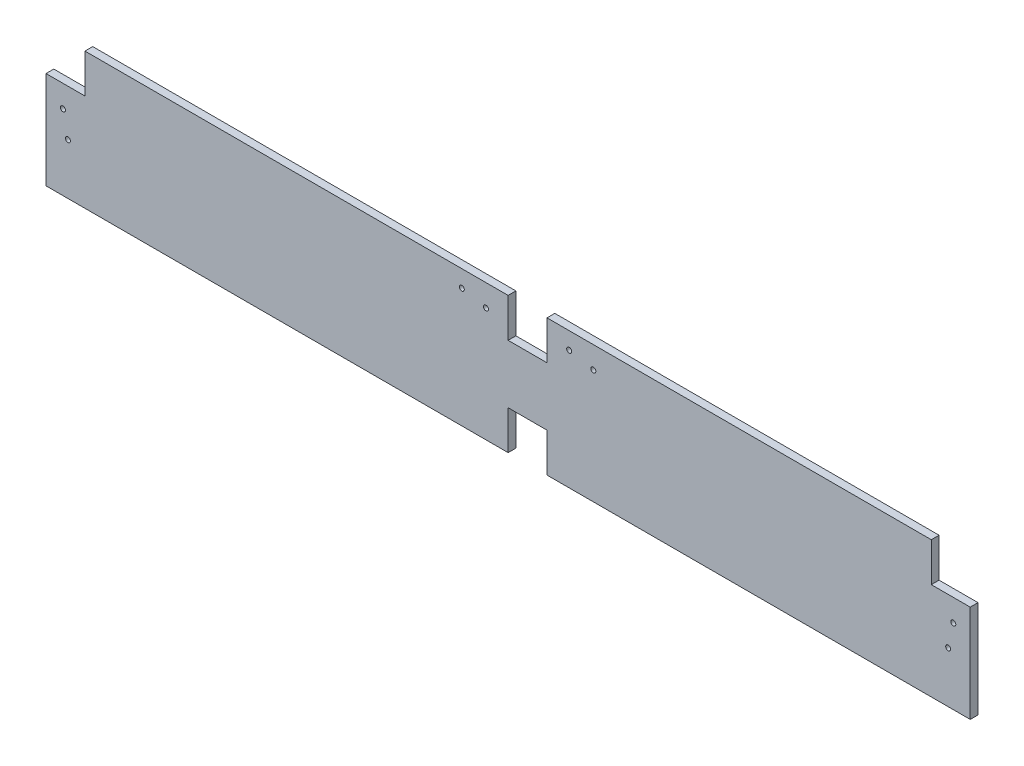
ISO-10303-21;
HEADER;
FILE_DESCRIPTION(('STEP AP214'),'2;1');
FILE_NAME('part.step','',(''),(''),'','','');
FILE_SCHEMA(('AUTOMOTIVE_DESIGN { 1 0 10303 214 1 1 1 1 }'));
ENDSEC;
DATA;
#1=APPLICATION_CONTEXT('core data for automotive mechanical design processes');
#2=APPLICATION_PROTOCOL_DEFINITION('international standard','automotive_design',2000,#1);
#3=PRODUCT_CONTEXT('',#1,'mechanical');
#4=PRODUCT('Part','Part','',(#3));
#5=PRODUCT_RELATED_PRODUCT_CATEGORY('part','',(#4));
#6=PRODUCT_DEFINITION_FORMATION('','',#4);
#7=PRODUCT_DEFINITION_CONTEXT('part definition',#1,'design');
#8=PRODUCT_DEFINITION('design','',#6,#7);
#9=PRODUCT_DEFINITION_SHAPE('','',#8);
#10=(LENGTH_UNIT() NAMED_UNIT(*) SI_UNIT(.MILLI.,.METRE.));
#11=(NAMED_UNIT(*) PLANE_ANGLE_UNIT() SI_UNIT($,.RADIAN.));
#12=(NAMED_UNIT(*) SI_UNIT($,.STERADIAN.) SOLID_ANGLE_UNIT());
#13=UNCERTAINTY_MEASURE_WITH_UNIT(LENGTH_MEASURE(1.E-05),#10,'distance_accuracy_value','');
#14=(GEOMETRIC_REPRESENTATION_CONTEXT(3) GLOBAL_UNCERTAINTY_ASSIGNED_CONTEXT((#13)) GLOBAL_UNIT_ASSIGNED_CONTEXT((#10,
#11,#12)) REPRESENTATION_CONTEXT('',''));
#15=CARTESIAN_POINT('',(0.,0.,0.));
#16=DIRECTION('',(0.,0.,1.));
#17=DIRECTION('',(1.,0.,0.));
#18=AXIS2_PLACEMENT_3D('',#15,#16,#17);
#19=CARTESIAN_POINT('',(301.625,-44.4499999999999,2.54));
#20=DIRECTION('',(0.,1.,0.));
#21=DIRECTION('',(-1.,0.,0.));
#22=AXIS2_PLACEMENT_3D('',#19,#20,#21);
#23=PLANE('',#22);
#24=DIRECTION('',(1.,0.,0.));
#25=VECTOR('',#24,1.);
#26=CARTESIAN_POINT('',(301.625,-44.4499999999999,-2.54));
#27=LINE('',#26,#25);
#28=CARTESIAN_POINT('',(-301.625,-44.45,-2.54));
#29=VERTEX_POINT('',#28);
#30=CARTESIAN_POINT('',(0.,-44.45,-2.54));
#31=VERTEX_POINT('',#30);
#32=EDGE_CURVE('E167',#29,#31,#27,.T.);
#33=ORIENTED_EDGE('',*,*,#32,.T.);
#34=DIRECTION('',(0.,0.,1.));
#35=VECTOR('',#34,1.);
#36=CARTESIAN_POINT('',(0.,-44.45,-2.54));
#37=LINE('',#36,#35);
#38=CARTESIAN_POINT('',(0.,-44.45,2.54));
#39=VERTEX_POINT('',#38);
#40=EDGE_CURVE('E208',#31,#39,#37,.T.);
#41=ORIENTED_EDGE('',*,*,#40,.T.);
#42=DIRECTION('',(1.,0.,0.));
#43=VECTOR('',#42,1.);
#44=CARTESIAN_POINT('',(301.625,-44.4499999999999,2.54));
#45=LINE('',#44,#43);
#46=CARTESIAN_POINT('',(-301.625,-44.45,2.54));
#47=VERTEX_POINT('',#46);
#48=EDGE_CURVE('E201',#47,#39,#45,.T.);
#49=ORIENTED_EDGE('',*,*,#48,.F.);
#50=DIRECTION('',(0.,0.,-1.));
#51=VECTOR('',#50,1.);
#52=CARTESIAN_POINT('',(-301.625,-44.45,2.54));
#53=LINE('',#52,#51);
#54=EDGE_CURVE('E11',#47,#29,#53,.T.);
#55=ORIENTED_EDGE('',*,*,#54,.T.);
#56=EDGE_LOOP('',(#33,#41,#49,#55));
#57=FACE_BOUND('',#56,.T.);
#58=ADVANCED_FACE('F34',(#57),#23,.F.);
#59=CARTESIAN_POINT('',(301.625,44.4500000000001,2.54));
#60=DIRECTION('',(0.,-1.,0.));
#61=DIRECTION('',(1.,0.,0.));
#62=AXIS2_PLACEMENT_3D('',#59,#60,#61);
#63=PLANE('',#62);
#64=DIRECTION('',(-1.,0.,0.));
#65=VECTOR('',#64,1.);
#66=CARTESIAN_POINT('',(301.625,44.4500000000001,-2.54));
#67=LINE('',#66,#65);
#68=CARTESIAN_POINT('',(0.,44.45,-2.54));
#69=VERTEX_POINT('',#68);
#70=CARTESIAN_POINT('',(-276.225,44.45,-2.54));
#71=VERTEX_POINT('',#70);
#72=EDGE_CURVE('E181',#69,#71,#67,.T.);
#73=ORIENTED_EDGE('',*,*,#72,.T.);
#74=DIRECTION('',(0.,0.,1.));
#75=VECTOR('',#74,1.);
#76=CARTESIAN_POINT('',(-276.225,44.45,-2.54));
#77=LINE('',#76,#75);
#78=CARTESIAN_POINT('',(-276.225,44.45,2.54));
#79=VERTEX_POINT('',#78);
#80=EDGE_CURVE('E169',#71,#79,#77,.T.);
#81=ORIENTED_EDGE('',*,*,#80,.T.);
#82=DIRECTION('',(-1.,0.,0.));
#83=VECTOR('',#82,1.);
#84=CARTESIAN_POINT('',(301.625,44.4500000000001,2.54));
#85=LINE('',#84,#83);
#86=CARTESIAN_POINT('',(0.,44.45,2.54));
#87=VERTEX_POINT('',#86);
#88=EDGE_CURVE('E175',#87,#79,#85,.T.);
#89=ORIENTED_EDGE('',*,*,#88,.F.);
#90=DIRECTION('',(0.,0.,1.));
#91=VECTOR('',#90,1.);
#92=CARTESIAN_POINT('',(0.,44.45,-2.54));
#93=LINE('',#92,#91);
#94=EDGE_CURVE('E260',#69,#87,#93,.T.);
#95=ORIENTED_EDGE('',*,*,#94,.F.);
#96=EDGE_LOOP('',(#73,#81,#89,#95));
#97=FACE_BOUND('',#96,.T.);
#98=ADVANCED_FACE('F374',(#97),#63,.F.);
#99=CARTESIAN_POINT('',(-301.625,44.45,2.54));
#100=DIRECTION('',(1.,0.,0.));
#101=DIRECTION('',(0.,1.,0.));
#102=AXIS2_PLACEMENT_3D('',#99,#100,#101);
#103=PLANE('',#102);
#104=DIRECTION('',(0.,-1.,0.));
#105=VECTOR('',#104,1.);
#106=CARTESIAN_POINT('',(-301.625,44.45,2.54));
#107=LINE('',#106,#105);
#108=CARTESIAN_POINT('',(-301.625,19.05,2.54));
#109=VERTEX_POINT('',#108);
#110=EDGE_CURVE('E162',#109,#47,#107,.T.);
#111=ORIENTED_EDGE('',*,*,#110,.F.);
#112=DIRECTION('',(0.,0.,1.));
#113=VECTOR('',#112,1.);
#114=CARTESIAN_POINT('',(-301.625,19.05,-2.54));
#115=LINE('',#114,#113);
#116=CARTESIAN_POINT('',(-301.625,19.05,-2.54));
#117=VERTEX_POINT('',#116);
#118=EDGE_CURVE('E150',#117,#109,#115,.T.);
#119=ORIENTED_EDGE('',*,*,#118,.F.);
#120=DIRECTION('',(0.,-1.,0.));
#121=VECTOR('',#120,1.);
#122=CARTESIAN_POINT('',(-301.625,44.45,-2.54));
#123=LINE('',#122,#121);
#124=EDGE_CURVE('E160',#117,#29,#123,.T.);
#125=ORIENTED_EDGE('',*,*,#124,.T.);
#126=ORIENTED_EDGE('',*,*,#54,.F.);
#127=EDGE_LOOP('',(#111,#119,#125,#126));
#128=FACE_BOUND('',#127,.T.);
#129=ADVANCED_FACE('F36',(#128),#103,.F.);
#130=CARTESIAN_POINT('',(25.4000000000001,-44.45,2.54));
#131=VERTEX_POINT('',#130);
#132=CARTESIAN_POINT('',(301.625,-44.4499999999999,2.54));
#133=VERTEX_POINT('',#132);
#134=EDGE_CURVE('E204',#131,#133,#45,.T.);
#135=ORIENTED_EDGE('',*,*,#134,.F.);
#136=DIRECTION('',(0.,0.,1.));
#137=VECTOR('',#136,1.);
#138=CARTESIAN_POINT('',(25.4000000000001,-44.45,-2.54));
#139=LINE('',#138,#137);
#140=CARTESIAN_POINT('',(25.4000000000001,-44.45,-2.54));
#141=VERTEX_POINT('',#140);
#142=EDGE_CURVE('E211',#141,#131,#139,.T.);
#143=ORIENTED_EDGE('',*,*,#142,.F.);
#144=CARTESIAN_POINT('',(301.625,-44.4499999999999,-2.54));
#145=VERTEX_POINT('',#144);
#146=EDGE_CURVE('E168',#141,#145,#27,.T.);
#147=ORIENTED_EDGE('',*,*,#146,.T.);
#148=DIRECTION('',(0.,0.,-1.));
#149=VECTOR('',#148,1.);
#150=CARTESIAN_POINT('',(301.625,-44.4499999999999,2.54));
#151=LINE('',#150,#149);
#152=EDGE_CURVE('E42',#133,#145,#151,.T.);
#153=ORIENTED_EDGE('',*,*,#152,.F.);
#154=EDGE_LOOP('',(#135,#143,#147,#153));
#155=FACE_BOUND('',#154,.T.);
#156=ADVANCED_FACE('F376',(#155),#23,.F.);
#157=CARTESIAN_POINT('',(301.625,44.4500000000001,2.54));
#158=DIRECTION('',(-1.,0.,0.));
#159=DIRECTION('',(0.,0.,1.));
#160=AXIS2_PLACEMENT_3D('',#157,#158,#159);
#161=PLANE('',#160);
#162=DIRECTION('',(0.,1.,0.));
#163=VECTOR('',#162,1.);
#164=CARTESIAN_POINT('',(301.625,44.4500000000001,-2.54));
#165=LINE('',#164,#163);
#166=CARTESIAN_POINT('',(301.625,19.05,-2.54));
#167=VERTEX_POINT('',#166);
#168=EDGE_CURVE('E178',#145,#167,#165,.T.);
#169=ORIENTED_EDGE('',*,*,#168,.T.);
#170=DIRECTION('',(0.,0.,1.));
#171=VECTOR('',#170,1.);
#172=CARTESIAN_POINT('',(301.625,19.05,-2.54));
#173=LINE('',#172,#171);
#174=CARTESIAN_POINT('',(301.625,19.05,2.54));
#175=VERTEX_POINT('',#174);
#176=EDGE_CURVE('E240',#167,#175,#173,.T.);
#177=ORIENTED_EDGE('',*,*,#176,.T.);
#178=DIRECTION('',(0.,1.,0.));
#179=VECTOR('',#178,1.);
#180=CARTESIAN_POINT('',(301.625,44.4500000000001,2.54));
#181=LINE('',#180,#179);
#182=EDGE_CURVE('E196',#133,#175,#181,.T.);
#183=ORIENTED_EDGE('',*,*,#182,.F.);
#184=ORIENTED_EDGE('',*,*,#152,.T.);
#185=EDGE_LOOP('',(#169,#177,#183,#184));
#186=FACE_BOUND('',#185,.T.);
#187=ADVANCED_FACE('F384',(#186),#161,.F.);
#188=CARTESIAN_POINT('',(276.225,44.4500000000001,-2.54));
#189=VERTEX_POINT('',#188);
#190=CARTESIAN_POINT('',(25.4000000000001,44.45,-2.54));
#191=VERTEX_POINT('',#190);
#192=EDGE_CURVE('E183',#189,#191,#67,.T.);
#193=ORIENTED_EDGE('',*,*,#192,.T.);
#194=DIRECTION('',(0.,0.,1.));
#195=VECTOR('',#194,1.);
#196=CARTESIAN_POINT('',(25.4000000000001,44.45,-2.54));
#197=LINE('',#196,#195);
#198=CARTESIAN_POINT('',(25.4000000000001,44.45,2.54));
#199=VERTEX_POINT('',#198);
#200=EDGE_CURVE('E257',#191,#199,#197,.T.);
#201=ORIENTED_EDGE('',*,*,#200,.T.);
#202=CARTESIAN_POINT('',(276.225,44.4500000000001,2.54));
#203=VERTEX_POINT('',#202);
#204=EDGE_CURVE('E185',#203,#199,#85,.T.);
#205=ORIENTED_EDGE('',*,*,#204,.F.);
#206=DIRECTION('',(0.,0.,1.));
#207=VECTOR('',#206,1.);
#208=CARTESIAN_POINT('',(276.225,44.4500000000001,-2.54));
#209=LINE('',#208,#207);
#210=EDGE_CURVE('E235',#189,#203,#209,.T.);
#211=ORIENTED_EDGE('',*,*,#210,.F.);
#212=EDGE_LOOP('',(#193,#201,#205,#211));
#213=FACE_BOUND('',#212,.T.);
#214=ADVANCED_FACE('F341',(#213),#63,.F.);
#215=CARTESIAN_POINT('',(0.,0.,2.54));
#216=DIRECTION('',(0.,0.,-1.));
#217=DIRECTION('',(-1.,0.,0.));
#218=AXIS2_PLACEMENT_3D('',#215,#216,#217);
#219=PLANE('',#218);
#220=CARTESIAN_POINT('',(55.626,30.099,2.54));
#221=DIRECTION('',(0.,0.,1.));
#222=DIRECTION('',(1.,0.,0.));
#223=AXIS2_PLACEMENT_3D('',#220,#221,#222);
#224=CIRCLE('',#223,1.63195);
#225=CARTESIAN_POINT('',(57.25795,30.099,2.54));
#226=VERTEX_POINT('',#225);
#227=EDGE_CURVE('E323',#226,#226,#224,.T.);
#228=ORIENTED_EDGE('',*,*,#227,.F.);
#229=EDGE_LOOP('',(#228));
#230=FACE_BOUND('',#229,.T.);
#231=CARTESIAN_POINT('',(39.878,33.401,2.54));
#232=DIRECTION('',(0.,0.,1.));
#233=DIRECTION('',(1.,0.,0.));
#234=AXIS2_PLACEMENT_3D('',#231,#232,#233);
#235=CIRCLE('',#234,1.63195);
#236=CARTESIAN_POINT('',(41.50995,33.401,2.54));
#237=VERTEX_POINT('',#236);
#238=EDGE_CURVE('E317',#237,#237,#235,.T.);
#239=ORIENTED_EDGE('',*,*,#238,.F.);
#240=EDGE_LOOP('',(#239));
#241=FACE_BOUND('',#240,.T.);
#242=CARTESIAN_POINT('',(290.576,4.57199999999998,2.54));
#243=DIRECTION('',(0.,0.,-1.));
#244=DIRECTION('',(-1.,0.,0.));
#245=AXIS2_PLACEMENT_3D('',#242,#243,#244);
#246=CIRCLE('',#245,1.63195);
#247=CARTESIAN_POINT('',(288.94405,4.57199999999998,2.54));
#248=VERTEX_POINT('',#247);
#249=EDGE_CURVE('E312',#248,#248,#246,.T.);
#250=ORIENTED_EDGE('',*,*,#249,.T.);
#251=EDGE_LOOP('',(#250));
#252=FACE_BOUND('',#251,.T.);
#253=CARTESIAN_POINT('',(287.274,-11.176,2.54));
#254=DIRECTION('',(0.,0.,-1.));
#255=DIRECTION('',(-1.,0.,0.));
#256=AXIS2_PLACEMENT_3D('',#253,#254,#255);
#257=CIRCLE('',#256,1.63195);
#258=CARTESIAN_POINT('',(285.64205,-11.176,2.54));
#259=VERTEX_POINT('',#258);
#260=EDGE_CURVE('E305',#259,#259,#257,.T.);
#261=ORIENTED_EDGE('',*,*,#260,.T.);
#262=EDGE_LOOP('',(#261));
#263=FACE_BOUND('',#262,.T.);
#264=CARTESIAN_POINT('',(-290.576,4.57199999999998,2.54));
#265=DIRECTION('',(0.,0.,1.));
#266=DIRECTION('',(1.,0.,0.));
#267=AXIS2_PLACEMENT_3D('',#264,#265,#266);
#268=CIRCLE('',#267,1.63195);
#269=CARTESIAN_POINT('',(-288.94405,4.57199999999998,2.54));
#270=VERTEX_POINT('',#269);
#271=EDGE_CURVE('E300',#270,#270,#268,.T.);
#272=ORIENTED_EDGE('',*,*,#271,.F.);
#273=EDGE_LOOP('',(#272));
#274=FACE_BOUND('',#273,.T.);
#275=CARTESIAN_POINT('',(-287.274,-11.176,2.54));
#276=DIRECTION('',(0.,0.,1.));
#277=DIRECTION('',(1.,0.,0.));
#278=AXIS2_PLACEMENT_3D('',#275,#276,#277);
#279=CIRCLE('',#278,1.63195);
#280=CARTESIAN_POINT('',(-285.64205,-11.176,2.54));
#281=VERTEX_POINT('',#280);
#282=EDGE_CURVE('E293',#281,#281,#279,.T.);
#283=ORIENTED_EDGE('',*,*,#282,.F.);
#284=EDGE_LOOP('',(#283));
#285=FACE_BOUND('',#284,.T.);
#286=CARTESIAN_POINT('',(-14.478,30.099,2.54));
#287=DIRECTION('',(0.,0.,1.));
#288=DIRECTION('',(1.,0.,0.));
#289=AXIS2_PLACEMENT_3D('',#286,#287,#288);
#290=CIRCLE('',#289,1.63195);
#291=CARTESIAN_POINT('',(-12.84605,30.099,2.54));
#292=VERTEX_POINT('',#291);
#293=EDGE_CURVE('E288',#292,#292,#290,.T.);
#294=ORIENTED_EDGE('',*,*,#293,.F.);
#295=EDGE_LOOP('',(#294));
#296=FACE_BOUND('',#295,.T.);
#297=CARTESIAN_POINT('',(-30.226,33.401,2.54));
#298=DIRECTION('',(0.,0.,1.));
#299=DIRECTION('',(1.,0.,0.));
#300=AXIS2_PLACEMENT_3D('',#297,#298,#299);
#301=CIRCLE('',#300,1.63195);
#302=CARTESIAN_POINT('',(-28.59405,33.401,2.54));
#303=VERTEX_POINT('',#302);
#304=EDGE_CURVE('E281',#303,#303,#301,.T.);
#305=ORIENTED_EDGE('',*,*,#304,.F.);
#306=EDGE_LOOP('',(#305));
#307=FACE_BOUND('',#306,.T.);
#308=ORIENTED_EDGE('',*,*,#88,.T.);
#309=DIRECTION('',(0.,1.,0.));
#310=VECTOR('',#309,1.);
#311=CARTESIAN_POINT('',(-276.225,44.45,2.54));
#312=LINE('',#311,#310);
#313=CARTESIAN_POINT('',(-276.225,19.05,2.54));
#314=VERTEX_POINT('',#313);
#315=EDGE_CURVE('E155',#314,#79,#312,.T.);
#316=ORIENTED_EDGE('',*,*,#315,.F.);
#317=DIRECTION('',(1.,0.,0.));
#318=VECTOR('',#317,1.);
#319=CARTESIAN_POINT('',(-301.625,19.05,2.54));
#320=LINE('',#319,#318);
#321=EDGE_CURVE('E262',#109,#314,#320,.T.);
#322=ORIENTED_EDGE('',*,*,#321,.F.);
#323=ORIENTED_EDGE('',*,*,#110,.T.);
#324=ORIENTED_EDGE('',*,*,#48,.T.);
#325=DIRECTION('',(0.,-1.,0.));
#326=VECTOR('',#325,1.);
#327=CARTESIAN_POINT('',(0.,-44.45,2.54));
#328=LINE('',#327,#326);
#329=CARTESIAN_POINT('',(0.,-19.05,2.54));
#330=VERTEX_POINT('',#329);
#331=EDGE_CURVE('E226',#330,#39,#328,.T.);
#332=ORIENTED_EDGE('',*,*,#331,.F.);
#333=DIRECTION('',(-1.,0.,0.));
#334=VECTOR('',#333,1.);
#335=CARTESIAN_POINT('',(0.,-19.05,2.54));
#336=LINE('',#335,#334);
#337=CARTESIAN_POINT('',(25.4000000000001,-19.05,2.54));
#338=VERTEX_POINT('',#337);
#339=EDGE_CURVE('E219',#338,#330,#336,.T.);
#340=ORIENTED_EDGE('',*,*,#339,.F.);
#341=DIRECTION('',(0.,1.,0.));
#342=VECTOR('',#341,1.);
#343=CARTESIAN_POINT('',(25.4000000000001,-44.45,2.54));
#344=LINE('',#343,#342);
#345=EDGE_CURVE('E223',#131,#338,#344,.T.);
#346=ORIENTED_EDGE('',*,*,#345,.F.);
#347=ORIENTED_EDGE('',*,*,#134,.T.);
#348=ORIENTED_EDGE('',*,*,#182,.T.);
#349=DIRECTION('',(1.,0.,0.));
#350=VECTOR('',#349,1.);
#351=CARTESIAN_POINT('',(301.625,19.05,2.54));
#352=LINE('',#351,#350);
#353=CARTESIAN_POINT('',(276.225,19.05,2.54));
#354=VERTEX_POINT('',#353);
#355=EDGE_CURVE('E244',#354,#175,#352,.T.);
#356=ORIENTED_EDGE('',*,*,#355,.F.);
#357=DIRECTION('',(0.,-1.,0.));
#358=VECTOR('',#357,1.);
#359=CARTESIAN_POINT('',(276.225,44.4500000000001,2.54));
#360=LINE('',#359,#358);
#361=EDGE_CURVE('E218',#203,#354,#360,.T.);
#362=ORIENTED_EDGE('',*,*,#361,.F.);
#363=ORIENTED_EDGE('',*,*,#204,.T.);
#364=DIRECTION('',(0.,1.,0.));
#365=VECTOR('',#364,1.);
#366=CARTESIAN_POINT('',(25.4000000000001,44.45,2.54));
#367=LINE('',#366,#365);
#368=CARTESIAN_POINT('',(25.4000000000001,19.05,2.54));
#369=VERTEX_POINT('',#368);
#370=EDGE_CURVE('E263',#369,#199,#367,.T.);
#371=ORIENTED_EDGE('',*,*,#370,.F.);
#372=DIRECTION('',(1.,0.,0.));
#373=VECTOR('',#372,1.);
#374=CARTESIAN_POINT('',(0.,19.05,2.54));
#375=LINE('',#374,#373);
#376=CARTESIAN_POINT('',(0.,19.05,2.54));
#377=VERTEX_POINT('',#376);
#378=EDGE_CURVE('E266',#377,#369,#375,.T.);
#379=ORIENTED_EDGE('',*,*,#378,.F.);
#380=DIRECTION('',(0.,-1.,0.));
#381=VECTOR('',#380,1.);
#382=CARTESIAN_POINT('',(0.,44.45,2.54));
#383=LINE('',#382,#381);
#384=EDGE_CURVE('E243',#87,#377,#383,.T.);
#385=ORIENTED_EDGE('',*,*,#384,.F.);
#386=EDGE_LOOP('',(#308,#316,#322,#323,#324,#332,#340,#346,#347,#348,#356,#362,#363,#371,#379,#385));
#387=FACE_BOUND('',#386,.T.);
#388=ADVANCED_FACE('F338',(#230,#241,#252,#263,#274,#285,#296,#307,#387),#219,.F.);
#389=CARTESIAN_POINT('',(0.,0.,-2.54));
#390=DIRECTION('',(0.,0.,-1.));
#391=DIRECTION('',(-1.,0.,0.));
#392=AXIS2_PLACEMENT_3D('',#389,#390,#391);
#393=PLANE('',#392);
#394=CARTESIAN_POINT('',(55.626,30.099,-2.54));
#395=DIRECTION('',(0.,0.,1.));
#396=DIRECTION('',(1.,0.,0.));
#397=AXIS2_PLACEMENT_3D('',#394,#395,#396);
#398=CIRCLE('',#397,1.63195);
#399=CARTESIAN_POINT('',(57.25795,30.099,-2.54));
#400=VERTEX_POINT('',#399);
#401=EDGE_CURVE('E309',#400,#400,#398,.T.);
#402=ORIENTED_EDGE('',*,*,#401,.T.);
#403=EDGE_LOOP('',(#402));
#404=FACE_BOUND('',#403,.T.);
#405=CARTESIAN_POINT('',(39.878,33.401,-2.54));
#406=DIRECTION('',(0.,0.,1.));
#407=DIRECTION('',(1.,0.,0.));
#408=AXIS2_PLACEMENT_3D('',#405,#406,#407);
#409=CIRCLE('',#408,1.63195);
#410=CARTESIAN_POINT('',(41.50995,33.401,-2.54));
#411=VERTEX_POINT('',#410);
#412=EDGE_CURVE('E320',#411,#411,#409,.T.);
#413=ORIENTED_EDGE('',*,*,#412,.T.);
#414=EDGE_LOOP('',(#413));
#415=FACE_BOUND('',#414,.T.);
#416=CARTESIAN_POINT('',(290.576,4.57199999999998,-2.54));
#417=DIRECTION('',(0.,0.,-1.));
#418=DIRECTION('',(-1.,0.,0.));
#419=AXIS2_PLACEMENT_3D('',#416,#417,#418);
#420=CIRCLE('',#419,1.63195);
#421=CARTESIAN_POINT('',(288.94405,4.57199999999998,-2.54));
#422=VERTEX_POINT('',#421);
#423=EDGE_CURVE('E297',#422,#422,#420,.T.);
#424=ORIENTED_EDGE('',*,*,#423,.F.);
#425=EDGE_LOOP('',(#424));
#426=FACE_BOUND('',#425,.T.);
#427=CARTESIAN_POINT('',(287.274,-11.176,-2.54));
#428=DIRECTION('',(0.,0.,-1.));
#429=DIRECTION('',(-1.,0.,0.));
#430=AXIS2_PLACEMENT_3D('',#427,#428,#429);
#431=CIRCLE('',#430,1.63195);
#432=CARTESIAN_POINT('',(285.64205,-11.176,-2.54));
#433=VERTEX_POINT('',#432);
#434=EDGE_CURVE('E308',#433,#433,#431,.T.);
#435=ORIENTED_EDGE('',*,*,#434,.F.);
#436=EDGE_LOOP('',(#435));
#437=FACE_BOUND('',#436,.T.);
#438=CARTESIAN_POINT('',(-290.576,4.57199999999998,-2.54));
#439=DIRECTION('',(0.,0.,1.));
#440=DIRECTION('',(1.,0.,0.));
#441=AXIS2_PLACEMENT_3D('',#438,#439,#440);
#442=CIRCLE('',#441,1.63195);
#443=CARTESIAN_POINT('',(-288.94405,4.57199999999998,-2.54));
#444=VERTEX_POINT('',#443);
#445=EDGE_CURVE('E285',#444,#444,#442,.T.);
#446=ORIENTED_EDGE('',*,*,#445,.T.);
#447=EDGE_LOOP('',(#446));
#448=FACE_BOUND('',#447,.T.);
#449=CARTESIAN_POINT('',(-287.274,-11.176,-2.54));
#450=DIRECTION('',(0.,0.,1.));
#451=DIRECTION('',(1.,0.,0.));
#452=AXIS2_PLACEMENT_3D('',#449,#450,#451);
#453=CIRCLE('',#452,1.63195);
#454=CARTESIAN_POINT('',(-285.64205,-11.176,-2.54));
#455=VERTEX_POINT('',#454);
#456=EDGE_CURVE('E296',#455,#455,#453,.T.);
#457=ORIENTED_EDGE('',*,*,#456,.T.);
#458=EDGE_LOOP('',(#457));
#459=FACE_BOUND('',#458,.T.);
#460=CARTESIAN_POINT('',(-14.478,30.099,-2.54));
#461=DIRECTION('',(0.,0.,1.));
#462=DIRECTION('',(1.,0.,0.));
#463=AXIS2_PLACEMENT_3D('',#460,#461,#462);
#464=CIRCLE('',#463,1.63195);
#465=CARTESIAN_POINT('',(-12.84605,30.099,-2.54));
#466=VERTEX_POINT('',#465);
#467=EDGE_CURVE('E228',#466,#466,#464,.T.);
#468=ORIENTED_EDGE('',*,*,#467,.T.);
#469=EDGE_LOOP('',(#468));
#470=FACE_BOUND('',#469,.T.);
#471=CARTESIAN_POINT('',(-30.226,33.401,-2.54));
#472=DIRECTION('',(0.,0.,1.));
#473=DIRECTION('',(1.,0.,0.));
#474=AXIS2_PLACEMENT_3D('',#471,#472,#473);
#475=CIRCLE('',#474,1.63195);
#476=CARTESIAN_POINT('',(-28.59405,33.401,-2.54));
#477=VERTEX_POINT('',#476);
#478=EDGE_CURVE('E284',#477,#477,#475,.T.);
#479=ORIENTED_EDGE('',*,*,#478,.T.);
#480=EDGE_LOOP('',(#479));
#481=FACE_BOUND('',#480,.T.);
#482=DIRECTION('',(0.,1.,0.));
#483=VECTOR('',#482,1.);
#484=CARTESIAN_POINT('',(-276.225,44.45,-2.54));
#485=LINE('',#484,#483);
#486=CARTESIAN_POINT('',(-276.225,19.05,-2.54));
#487=VERTEX_POINT('',#486);
#488=EDGE_CURVE('E49',#487,#71,#485,.T.);
#489=ORIENTED_EDGE('',*,*,#488,.T.);
#490=ORIENTED_EDGE('',*,*,#72,.F.);
#491=DIRECTION('',(0.,-1.,0.));
#492=VECTOR('',#491,1.);
#493=CARTESIAN_POINT('',(0.,44.45,-2.54));
#494=LINE('',#493,#492);
#495=CARTESIAN_POINT('',(0.,19.05,-2.54));
#496=VERTEX_POINT('',#495);
#497=EDGE_CURVE('E265',#69,#496,#494,.T.);
#498=ORIENTED_EDGE('',*,*,#497,.T.);
#499=DIRECTION('',(1.,0.,0.));
#500=VECTOR('',#499,1.);
#501=CARTESIAN_POINT('',(0.,19.05,-2.54));
#502=LINE('',#501,#500);
#503=CARTESIAN_POINT('',(25.4000000000001,19.05,-2.54));
#504=VERTEX_POINT('',#503);
#505=EDGE_CURVE('E272',#496,#504,#502,.T.);
#506=ORIENTED_EDGE('',*,*,#505,.T.);
#507=DIRECTION('',(0.,1.,0.));
#508=VECTOR('',#507,1.);
#509=CARTESIAN_POINT('',(25.4000000000001,44.45,-2.54));
#510=LINE('',#509,#508);
#511=EDGE_CURVE('E57',#504,#191,#510,.T.);
#512=ORIENTED_EDGE('',*,*,#511,.T.);
#513=ORIENTED_EDGE('',*,*,#192,.F.);
#514=DIRECTION('',(0.,-1.,0.));
#515=VECTOR('',#514,1.);
#516=CARTESIAN_POINT('',(276.225,44.4500000000001,-2.54));
#517=LINE('',#516,#515);
#518=CARTESIAN_POINT('',(276.225,19.05,-2.54));
#519=VERTEX_POINT('',#518);
#520=EDGE_CURVE('E246',#189,#519,#517,.T.);
#521=ORIENTED_EDGE('',*,*,#520,.T.);
#522=DIRECTION('',(1.,0.,0.));
#523=VECTOR('',#522,1.);
#524=CARTESIAN_POINT('',(301.625,19.05,-2.54));
#525=LINE('',#524,#523);
#526=EDGE_CURVE('E238',#519,#167,#525,.T.);
#527=ORIENTED_EDGE('',*,*,#526,.T.);
#528=ORIENTED_EDGE('',*,*,#168,.F.);
#529=ORIENTED_EDGE('',*,*,#146,.F.);
#530=DIRECTION('',(0.,1.,0.));
#531=VECTOR('',#530,1.);
#532=CARTESIAN_POINT('',(25.4000000000001,-44.45,-2.54));
#533=LINE('',#532,#531);
#534=CARTESIAN_POINT('',(25.4000000000001,-19.05,-2.54));
#535=VERTEX_POINT('',#534);
#536=EDGE_CURVE('E231',#141,#535,#533,.T.);
#537=ORIENTED_EDGE('',*,*,#536,.T.);
#538=DIRECTION('',(-1.,0.,0.));
#539=VECTOR('',#538,1.);
#540=CARTESIAN_POINT('',(0.,-19.05,-2.54));
#541=LINE('',#540,#539);
#542=CARTESIAN_POINT('',(0.,-19.05,-2.54));
#543=VERTEX_POINT('',#542);
#544=EDGE_CURVE('E212',#535,#543,#541,.T.);
#545=ORIENTED_EDGE('',*,*,#544,.T.);
#546=DIRECTION('',(0.,-1.,0.));
#547=VECTOR('',#546,1.);
#548=CARTESIAN_POINT('',(0.,-44.45,-2.54));
#549=LINE('',#548,#547);
#550=EDGE_CURVE('E222',#543,#31,#549,.T.);
#551=ORIENTED_EDGE('',*,*,#550,.T.);
#552=ORIENTED_EDGE('',*,*,#32,.F.);
#553=ORIENTED_EDGE('',*,*,#124,.F.);
#554=DIRECTION('',(1.,0.,0.));
#555=VECTOR('',#554,1.);
#556=CARTESIAN_POINT('',(-301.625,19.05,-2.54));
#557=LINE('',#556,#555);
#558=EDGE_CURVE('E146',#117,#487,#557,.T.);
#559=ORIENTED_EDGE('',*,*,#558,.T.);
#560=EDGE_LOOP('',(#489,#490,#498,#506,#512,#513,#521,#527,#528,#529,#537,#545,#551,#552,#553,#559));
#561=FACE_BOUND('',#560,.T.);
#562=ADVANCED_FACE('F164',(#404,#415,#426,#437,#448,#459,#470,#481,#561),#393,.T.);
#563=CARTESIAN_POINT('',(0.,-44.45,-2.54));
#564=DIRECTION('',(-1.,0.,0.));
#565=DIRECTION('',(0.,-1.,0.));
#566=AXIS2_PLACEMENT_3D('',#563,#564,#565);
#567=PLANE('',#566);
#568=ORIENTED_EDGE('',*,*,#331,.T.);
#569=ORIENTED_EDGE('',*,*,#40,.F.);
#570=ORIENTED_EDGE('',*,*,#550,.F.);
#571=DIRECTION('',(0.,0.,1.));
#572=VECTOR('',#571,1.);
#573=CARTESIAN_POINT('',(0.,-19.05,-2.54));
#574=LINE('',#573,#572);
#575=EDGE_CURVE('E216',#543,#330,#574,.T.);
#576=ORIENTED_EDGE('',*,*,#575,.T.);
#577=EDGE_LOOP('',(#568,#569,#570,#576));
#578=FACE_BOUND('',#577,.T.);
#579=ADVANCED_FACE('F418',(#578),#567,.F.);
#580=CARTESIAN_POINT('',(0.,-19.05,-2.54));
#581=DIRECTION('',(0.,1.,0.));
#582=DIRECTION('',(-1.,0.,0.));
#583=AXIS2_PLACEMENT_3D('',#580,#581,#582);
#584=PLANE('',#583);
#585=ORIENTED_EDGE('',*,*,#339,.T.);
#586=ORIENTED_EDGE('',*,*,#575,.F.);
#587=ORIENTED_EDGE('',*,*,#544,.F.);
#588=DIRECTION('',(0.,0.,1.));
#589=VECTOR('',#588,1.);
#590=CARTESIAN_POINT('',(25.4000000000001,-19.05,-2.54));
#591=LINE('',#590,#589);
#592=EDGE_CURVE('E214',#535,#338,#591,.T.);
#593=ORIENTED_EDGE('',*,*,#592,.T.);
#594=EDGE_LOOP('',(#585,#586,#587,#593));
#595=FACE_BOUND('',#594,.T.);
#596=ADVANCED_FACE('F420',(#595),#584,.F.);
#597=CARTESIAN_POINT('',(25.4000000000001,-44.45,-2.54));
#598=DIRECTION('',(1.,0.,0.));
#599=DIRECTION('',(0.,1.,0.));
#600=AXIS2_PLACEMENT_3D('',#597,#598,#599);
#601=PLANE('',#600);
#602=ORIENTED_EDGE('',*,*,#345,.T.);
#603=ORIENTED_EDGE('',*,*,#592,.F.);
#604=ORIENTED_EDGE('',*,*,#536,.F.);
#605=ORIENTED_EDGE('',*,*,#142,.T.);
#606=EDGE_LOOP('',(#602,#603,#604,#605));
#607=FACE_BOUND('',#606,.T.);
#608=ADVANCED_FACE('F398',(#607),#601,.F.);
#609=CARTESIAN_POINT('',(301.625,19.05,-2.54));
#610=DIRECTION('',(0.,-1.,0.));
#611=DIRECTION('',(1.,0.,0.));
#612=AXIS2_PLACEMENT_3D('',#609,#610,#611);
#613=PLANE('',#612);
#614=ORIENTED_EDGE('',*,*,#355,.T.);
#615=ORIENTED_EDGE('',*,*,#176,.F.);
#616=ORIENTED_EDGE('',*,*,#526,.F.);
#617=DIRECTION('',(0.,0.,1.));
#618=VECTOR('',#617,1.);
#619=CARTESIAN_POINT('',(276.225,19.05,-2.54));
#620=LINE('',#619,#618);
#621=EDGE_CURVE('E237',#519,#354,#620,.T.);
#622=ORIENTED_EDGE('',*,*,#621,.T.);
#623=EDGE_LOOP('',(#614,#615,#616,#622));
#624=FACE_BOUND('',#623,.T.);
#625=ADVANCED_FACE('F400',(#624),#613,.F.);
#626=CARTESIAN_POINT('',(276.225,44.4500000000001,-2.54));
#627=DIRECTION('',(-1.,0.,0.));
#628=DIRECTION('',(0.,0.,1.));
#629=AXIS2_PLACEMENT_3D('',#626,#627,#628);
#630=PLANE('',#629);
#631=ORIENTED_EDGE('',*,*,#361,.T.);
#632=ORIENTED_EDGE('',*,*,#621,.F.);
#633=ORIENTED_EDGE('',*,*,#520,.F.);
#634=ORIENTED_EDGE('',*,*,#210,.T.);
#635=EDGE_LOOP('',(#631,#632,#633,#634));
#636=FACE_BOUND('',#635,.T.);
#637=ADVANCED_FACE('F430',(#636),#630,.F.);
#638=CARTESIAN_POINT('',(0.,44.45,-2.54));
#639=DIRECTION('',(-1.,0.,0.));
#640=DIRECTION('',(0.,-1.,0.));
#641=AXIS2_PLACEMENT_3D('',#638,#639,#640);
#642=PLANE('',#641);
#643=ORIENTED_EDGE('',*,*,#384,.T.);
#644=DIRECTION('',(0.,0.,1.));
#645=VECTOR('',#644,1.);
#646=CARTESIAN_POINT('',(0.,19.05,-2.54));
#647=LINE('',#646,#645);
#648=EDGE_CURVE('E253',#496,#377,#647,.T.);
#649=ORIENTED_EDGE('',*,*,#648,.F.);
#650=ORIENTED_EDGE('',*,*,#497,.F.);
#651=ORIENTED_EDGE('',*,*,#94,.T.);
#652=EDGE_LOOP('',(#643,#649,#650,#651));
#653=FACE_BOUND('',#652,.T.);
#654=ADVANCED_FACE('F480',(#653),#642,.F.);
#655=CARTESIAN_POINT('',(25.4000000000001,44.45,-2.54));
#656=DIRECTION('',(1.,0.,0.));
#657=DIRECTION('',(0.,1.,0.));
#658=AXIS2_PLACEMENT_3D('',#655,#656,#657);
#659=PLANE('',#658);
#660=ORIENTED_EDGE('',*,*,#370,.T.);
#661=ORIENTED_EDGE('',*,*,#200,.F.);
#662=ORIENTED_EDGE('',*,*,#511,.F.);
#663=DIRECTION('',(0.,0.,1.));
#664=VECTOR('',#663,1.);
#665=CARTESIAN_POINT('',(25.4000000000001,19.05,-2.54));
#666=LINE('',#665,#664);
#667=EDGE_CURVE('E255',#504,#369,#666,.T.);
#668=ORIENTED_EDGE('',*,*,#667,.T.);
#669=EDGE_LOOP('',(#660,#661,#662,#668));
#670=FACE_BOUND('',#669,.T.);
#671=ADVANCED_FACE('F407',(#670),#659,.F.);
#672=CARTESIAN_POINT('',(0.,19.05,-2.54));
#673=DIRECTION('',(0.,-1.,0.));
#674=DIRECTION('',(0.,0.,-1.));
#675=AXIS2_PLACEMENT_3D('',#672,#673,#674);
#676=PLANE('',#675);
#677=ORIENTED_EDGE('',*,*,#378,.T.);
#678=ORIENTED_EDGE('',*,*,#667,.F.);
#679=ORIENTED_EDGE('',*,*,#505,.F.);
#680=ORIENTED_EDGE('',*,*,#648,.T.);
#681=EDGE_LOOP('',(#677,#678,#679,#680));
#682=FACE_BOUND('',#681,.T.);
#683=ADVANCED_FACE('F411',(#682),#676,.F.);
#684=CARTESIAN_POINT('',(-276.225,44.45,-2.54));
#685=DIRECTION('',(1.,0.,0.));
#686=DIRECTION('',(0.,0.,-1.));
#687=AXIS2_PLACEMENT_3D('',#684,#685,#686);
#688=PLANE('',#687);
#689=ORIENTED_EDGE('',*,*,#315,.T.);
#690=ORIENTED_EDGE('',*,*,#80,.F.);
#691=ORIENTED_EDGE('',*,*,#488,.F.);
#692=DIRECTION('',(0.,0.,1.));
#693=VECTOR('',#692,1.);
#694=CARTESIAN_POINT('',(-276.225,19.05,-2.54));
#695=LINE('',#694,#693);
#696=EDGE_CURVE('E152',#487,#314,#695,.T.);
#697=ORIENTED_EDGE('',*,*,#696,.T.);
#698=EDGE_LOOP('',(#689,#690,#691,#697));
#699=FACE_BOUND('',#698,.T.);
#700=ADVANCED_FACE('F369',(#699),#688,.F.);
#701=CARTESIAN_POINT('',(-301.625,19.05,-2.54));
#702=DIRECTION('',(0.,-1.,0.));
#703=DIRECTION('',(0.,0.,-1.));
#704=AXIS2_PLACEMENT_3D('',#701,#702,#703);
#705=PLANE('',#704);
#706=ORIENTED_EDGE('',*,*,#321,.T.);
#707=ORIENTED_EDGE('',*,*,#696,.F.);
#708=ORIENTED_EDGE('',*,*,#558,.F.);
#709=ORIENTED_EDGE('',*,*,#118,.T.);
#710=EDGE_LOOP('',(#706,#707,#708,#709));
#711=FACE_BOUND('',#710,.T.);
#712=ADVANCED_FACE('F149',(#711),#705,.F.);
#713=CARTESIAN_POINT('',(-30.226,33.401,-2.54));
#714=DIRECTION('',(0.,0.,1.));
#715=DIRECTION('',(1.,0.,0.));
#716=AXIS2_PLACEMENT_3D('',#713,#714,#715);
#717=CYLINDRICAL_SURFACE('',#716,1.63195);
#718=ORIENTED_EDGE('',*,*,#478,.F.);
#719=EDGE_LOOP('',(#718));
#720=FACE_BOUND('',#719,.T.);
#721=ORIENTED_EDGE('',*,*,#304,.T.);
#722=EDGE_LOOP('',(#721));
#723=FACE_BOUND('',#722,.T.);
#724=ADVANCED_FACE('F357',(#720,#723),#717,.F.);
#725=CARTESIAN_POINT('',(-14.478,30.099,-2.54));
#726=DIRECTION('',(0.,0.,1.));
#727=DIRECTION('',(1.,0.,0.));
#728=AXIS2_PLACEMENT_3D('',#725,#726,#727);
#729=CYLINDRICAL_SURFACE('',#728,1.63195);
#730=ORIENTED_EDGE('',*,*,#467,.F.);
#731=EDGE_LOOP('',(#730));
#732=FACE_BOUND('',#731,.T.);
#733=ORIENTED_EDGE('',*,*,#293,.T.);
#734=EDGE_LOOP('',(#733));
#735=FACE_BOUND('',#734,.T.);
#736=ADVANCED_FACE('F359',(#732,#735),#729,.F.);
#737=CARTESIAN_POINT('',(-287.274,-11.176,-2.54));
#738=DIRECTION('',(0.,0.,1.));
#739=DIRECTION('',(1.,0.,0.));
#740=AXIS2_PLACEMENT_3D('',#737,#738,#739);
#741=CYLINDRICAL_SURFACE('',#740,1.63195);
#742=ORIENTED_EDGE('',*,*,#456,.F.);
#743=EDGE_LOOP('',(#742));
#744=FACE_BOUND('',#743,.T.);
#745=ORIENTED_EDGE('',*,*,#282,.T.);
#746=EDGE_LOOP('',(#745));
#747=FACE_BOUND('',#746,.T.);
#748=ADVANCED_FACE('F366',(#744,#747),#741,.F.);
#749=CARTESIAN_POINT('',(-290.576,4.57199999999998,-2.54));
#750=DIRECTION('',(0.,0.,1.));
#751=DIRECTION('',(1.,0.,0.));
#752=AXIS2_PLACEMENT_3D('',#749,#750,#751);
#753=CYLINDRICAL_SURFACE('',#752,1.63195);
#754=ORIENTED_EDGE('',*,*,#445,.F.);
#755=EDGE_LOOP('',(#754));
#756=FACE_BOUND('',#755,.T.);
#757=ORIENTED_EDGE('',*,*,#271,.T.);
#758=EDGE_LOOP('',(#757));
#759=FACE_BOUND('',#758,.T.);
#760=ADVANCED_FACE('F535',(#756,#759),#753,.F.);
#761=CARTESIAN_POINT('',(287.274,-11.176,-2.54));
#762=DIRECTION('',(0.,0.,1.));
#763=DIRECTION('',(1.,0.,0.));
#764=AXIS2_PLACEMENT_3D('',#761,#762,#763);
#765=CYLINDRICAL_SURFACE('',#764,1.63195);
#766=ORIENTED_EDGE('',*,*,#434,.T.);
#767=EDGE_LOOP('',(#766));
#768=FACE_BOUND('',#767,.T.);
#769=ORIENTED_EDGE('',*,*,#260,.F.);
#770=EDGE_LOOP('',(#769));
#771=FACE_BOUND('',#770,.T.);
#772=ADVANCED_FACE('F545',(#768,#771),#765,.F.);
#773=CARTESIAN_POINT('',(290.576,4.57199999999998,-2.54));
#774=DIRECTION('',(0.,0.,1.));
#775=DIRECTION('',(1.,0.,0.));
#776=AXIS2_PLACEMENT_3D('',#773,#774,#775);
#777=CYLINDRICAL_SURFACE('',#776,1.63195);
#778=ORIENTED_EDGE('',*,*,#423,.T.);
#779=EDGE_LOOP('',(#778));
#780=FACE_BOUND('',#779,.T.);
#781=ORIENTED_EDGE('',*,*,#249,.F.);
#782=EDGE_LOOP('',(#781));
#783=FACE_BOUND('',#782,.T.);
#784=ADVANCED_FACE('F554',(#780,#783),#777,.F.);
#785=CARTESIAN_POINT('',(39.878,33.401,-2.54));
#786=DIRECTION('',(0.,0.,1.));
#787=DIRECTION('',(1.,0.,0.));
#788=AXIS2_PLACEMENT_3D('',#785,#786,#787);
#789=CYLINDRICAL_SURFACE('',#788,1.63195);
#790=ORIENTED_EDGE('',*,*,#412,.F.);
#791=EDGE_LOOP('',(#790));
#792=FACE_BOUND('',#791,.T.);
#793=ORIENTED_EDGE('',*,*,#238,.T.);
#794=EDGE_LOOP('',(#793));
#795=FACE_BOUND('',#794,.T.);
#796=ADVANCED_FACE('F334',(#792,#795),#789,.F.);
#797=CARTESIAN_POINT('',(55.626,30.099,-2.54));
#798=DIRECTION('',(0.,0.,1.));
#799=DIRECTION('',(1.,0.,0.));
#800=AXIS2_PLACEMENT_3D('',#797,#798,#799);
#801=CYLINDRICAL_SURFACE('',#800,1.63195);
#802=ORIENTED_EDGE('',*,*,#401,.F.);
#803=EDGE_LOOP('',(#802));
#804=FACE_BOUND('',#803,.T.);
#805=ORIENTED_EDGE('',*,*,#227,.T.);
#806=EDGE_LOOP('',(#805));
#807=FACE_BOUND('',#806,.T.);
#808=ADVANCED_FACE('F331',(#804,#807),#801,.F.);
#809=CLOSED_SHELL('',(#58,#98,#129,#156,#187,#214,#388,#562,#579,#596,#608,#625,#637,#654,#671,
#683,#700,#712,#724,#736,#748,#760,#772,#784,#796,#808));
#810=MANIFOLD_SOLID_BREP('B2',#809);
#811=ADVANCED_BREP_SHAPE_REPRESENTATION('',(#18,#810),#14);
#812=SHAPE_DEFINITION_REPRESENTATION(#9,#811);
ENDSEC;
END-ISO-10303-21;
